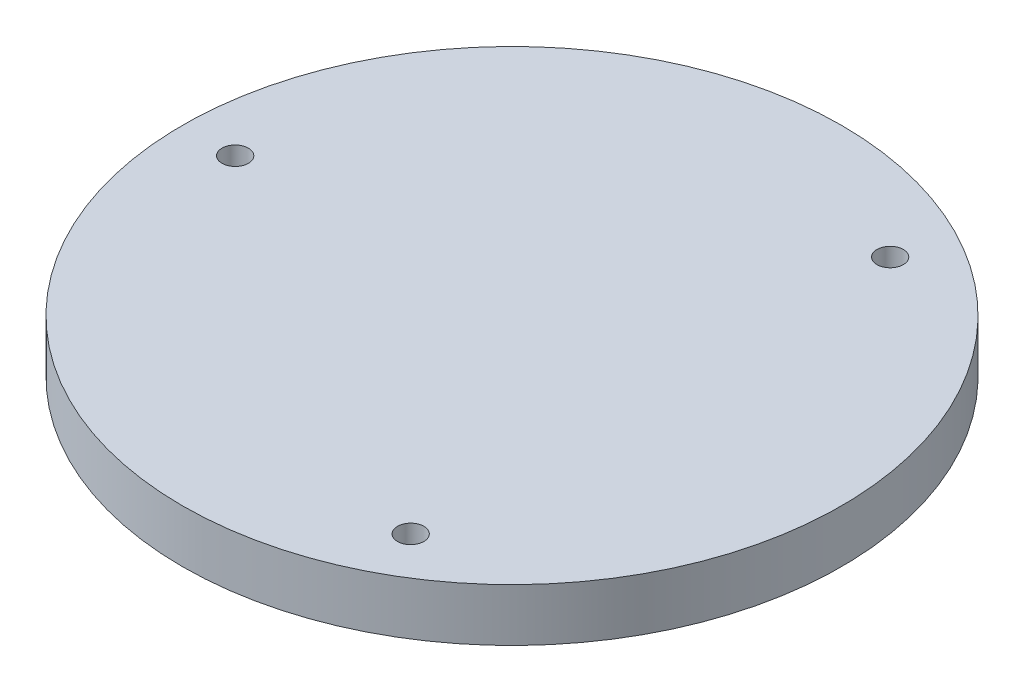
ISO-10303-21;
HEADER;
FILE_DESCRIPTION(('STEP AP214'),'2;1');
FILE_NAME('part.step','',(''),(''),'','','');
FILE_SCHEMA(('AUTOMOTIVE_DESIGN { 1 0 10303 214 1 1 1 1 }'));
ENDSEC;
DATA;
#1=APPLICATION_CONTEXT('core data for automotive mechanical design processes');
#2=APPLICATION_PROTOCOL_DEFINITION('international standard','automotive_design',2000,#1);
#3=PRODUCT_CONTEXT('',#1,'mechanical');
#4=PRODUCT('Part','Part','',(#3));
#5=PRODUCT_RELATED_PRODUCT_CATEGORY('part','',(#4));
#6=PRODUCT_DEFINITION_FORMATION('','',#4);
#7=PRODUCT_DEFINITION_CONTEXT('part definition',#1,'design');
#8=PRODUCT_DEFINITION('design','',#6,#7);
#9=PRODUCT_DEFINITION_SHAPE('','',#8);
#10=(LENGTH_UNIT() NAMED_UNIT(*) SI_UNIT(.MILLI.,.METRE.));
#11=(NAMED_UNIT(*) PLANE_ANGLE_UNIT() SI_UNIT($,.RADIAN.));
#12=(NAMED_UNIT(*) SI_UNIT($,.STERADIAN.) SOLID_ANGLE_UNIT());
#13=UNCERTAINTY_MEASURE_WITH_UNIT(LENGTH_MEASURE(1.E-05),#10,'distance_accuracy_value','');
#14=(GEOMETRIC_REPRESENTATION_CONTEXT(3) GLOBAL_UNCERTAINTY_ASSIGNED_CONTEXT((#13)) GLOBAL_UNIT_ASSIGNED_CONTEXT((#10,
#11,#12)) REPRESENTATION_CONTEXT('',''));
#15=CARTESIAN_POINT('',(0.,0.,0.));
#16=DIRECTION('',(0.,0.,1.));
#17=DIRECTION('',(1.,0.,0.));
#18=AXIS2_PLACEMENT_3D('',#15,#16,#17);
#19=CARTESIAN_POINT('',(0.,20.,0.));
#20=DIRECTION('',(0.,-1.,0.));
#21=DIRECTION('',(0.,0.,-1.));
#22=AXIS2_PLACEMENT_3D('',#19,#20,#21);
#23=CYLINDRICAL_SURFACE('',#22,125.);
#24=CARTESIAN_POINT('',(0.,20.,0.));
#25=DIRECTION('',(0.,1.,0.));
#26=DIRECTION('',(0.,0.,1.));
#27=AXIS2_PLACEMENT_3D('',#24,#25,#26);
#28=CIRCLE('',#27,125.);
#29=CARTESIAN_POINT('',(0.,20.,125.));
#30=VERTEX_POINT('',#29);
#31=EDGE_CURVE('E10',#30,#30,#28,.T.);
#32=ORIENTED_EDGE('',*,*,#31,.F.);
#33=EDGE_LOOP('',(#32));
#34=FACE_BOUND('',#33,.T.);
#35=CARTESIAN_POINT('',(0.,0.,0.));
#36=DIRECTION('',(0.,1.,0.));
#37=DIRECTION('',(0.,0.,1.));
#38=AXIS2_PLACEMENT_3D('',#35,#36,#37);
#39=CIRCLE('',#38,125.);
#40=CARTESIAN_POINT('',(0.,0.,125.));
#41=VERTEX_POINT('',#40);
#42=EDGE_CURVE('E39',#41,#41,#39,.T.);
#43=ORIENTED_EDGE('',*,*,#42,.T.);
#44=EDGE_LOOP('',(#43));
#45=FACE_BOUND('',#44,.T.);
#46=ADVANCED_FACE('F36',(#34,#45),#23,.T.);
#47=CARTESIAN_POINT('',(0.,20.,0.));
#48=DIRECTION('',(0.,1.,0.));
#49=DIRECTION('',(0.,0.,1.));
#50=AXIS2_PLACEMENT_3D('',#47,#48,#49);
#51=PLANE('',#50);
#52=CARTESIAN_POINT('',(52.5000000000004,20.,90.9326673973658));
#53=DIRECTION('',(0.,1.,0.));
#54=DIRECTION('',(0.866025403784436,0.,-0.500000000000004));
#55=AXIS2_PLACEMENT_3D('',#52,#53,#54);
#56=CIRCLE('',#55,5.);
#57=CARTESIAN_POINT('',(56.8301270189226,20.,88.4326673973658));
#58=VERTEX_POINT('',#57);
#59=EDGE_CURVE('E71',#58,#58,#56,.T.);
#60=ORIENTED_EDGE('',*,*,#59,.F.);
#61=EDGE_LOOP('',(#60));
#62=FACE_BOUND('',#61,.T.);
#63=CARTESIAN_POINT('',(52.4999999999992,20.,-90.9326673973665));
#64=DIRECTION('',(0.,1.,0.));
#65=DIRECTION('',(-0.866025403784443,0.,-0.499999999999992));
#66=AXIS2_PLACEMENT_3D('',#63,#64,#65);
#67=CIRCLE('',#66,5.);
#68=CARTESIAN_POINT('',(48.1698729810769,20.,-93.4326673973665));
#69=VERTEX_POINT('',#68);
#70=EDGE_CURVE('E80',#69,#69,#67,.T.);
#71=ORIENTED_EDGE('',*,*,#70,.F.);
#72=EDGE_LOOP('',(#71));
#73=FACE_BOUND('',#72,.T.);
#74=CARTESIAN_POINT('',(-105.,20.,0.));
#75=DIRECTION('',(0.,1.,0.));
#76=DIRECTION('',(0.,0.,1.));
#77=AXIS2_PLACEMENT_3D('',#74,#75,#76);
#78=CIRCLE('',#77,5.);
#79=CARTESIAN_POINT('',(-105.,20.,5.));
#80=VERTEX_POINT('',#79);
#81=EDGE_CURVE('E62',#80,#80,#78,.T.);
#82=ORIENTED_EDGE('',*,*,#81,.F.);
#83=EDGE_LOOP('',(#82));
#84=FACE_BOUND('',#83,.T.);
#85=ORIENTED_EDGE('',*,*,#31,.T.);
#86=EDGE_LOOP('',(#85));
#87=FACE_BOUND('',#86,.T.);
#88=ADVANCED_FACE('F102',(#62,#73,#84,#87),#51,.T.);
#89=CARTESIAN_POINT('',(0.,0.,0.));
#90=DIRECTION('',(0.,1.,0.));
#91=DIRECTION('',(0.,0.,1.));
#92=AXIS2_PLACEMENT_3D('',#89,#90,#91);
#93=PLANE('',#92);
#94=CARTESIAN_POINT('',(52.5000000000004,0.,90.9326673973658));
#95=DIRECTION('',(0.,1.,0.));
#96=DIRECTION('',(0.866025403784436,0.,-0.500000000000004));
#97=AXIS2_PLACEMENT_3D('',#94,#95,#96);
#98=CIRCLE('',#97,2.65);
#99=CARTESIAN_POINT('',(54.7949673200292,0.,89.6076673973658));
#100=VERTEX_POINT('',#99);
#101=EDGE_CURVE('E91',#100,#100,#98,.T.);
#102=ORIENTED_EDGE('',*,*,#101,.T.);
#103=EDGE_LOOP('',(#102));
#104=FACE_BOUND('',#103,.T.);
#105=CARTESIAN_POINT('',(52.4999999999992,0.,-90.9326673973665));
#106=DIRECTION('',(0.,1.,0.));
#107=DIRECTION('',(-0.866025403784443,0.,-0.499999999999992));
#108=AXIS2_PLACEMENT_3D('',#105,#106,#107);
#109=CIRCLE('',#108,2.65);
#110=CARTESIAN_POINT('',(50.2050326799704,0.,-92.2576673973665));
#111=VERTEX_POINT('',#110);
#112=EDGE_CURVE('E76',#111,#111,#109,.T.);
#113=ORIENTED_EDGE('',*,*,#112,.T.);
#114=EDGE_LOOP('',(#113));
#115=FACE_BOUND('',#114,.T.);
#116=CARTESIAN_POINT('',(-105.,0.,0.));
#117=DIRECTION('',(0.,1.,0.));
#118=DIRECTION('',(0.,0.,1.));
#119=AXIS2_PLACEMENT_3D('',#116,#117,#118);
#120=CIRCLE('',#119,2.65);
#121=CARTESIAN_POINT('',(-105.,0.,2.65));
#122=VERTEX_POINT('',#121);
#123=EDGE_CURVE('E49',#122,#122,#120,.T.);
#124=ORIENTED_EDGE('',*,*,#123,.T.);
#125=EDGE_LOOP('',(#124));
#126=FACE_BOUND('',#125,.T.);
#127=ORIENTED_EDGE('',*,*,#42,.F.);
#128=EDGE_LOOP('',(#127));
#129=FACE_BOUND('',#128,.T.);
#130=ADVANCED_FACE('F105',(#104,#115,#126,#129),#93,.F.);
#131=CARTESIAN_POINT('',(-105.,20.,0.));
#132=DIRECTION('',(0.,1.,0.));
#133=DIRECTION('',(0.,0.,1.));
#134=AXIS2_PLACEMENT_3D('',#131,#132,#133);
#135=CYLINDRICAL_SURFACE('',#134,2.65);
#136=ORIENTED_EDGE('',*,*,#123,.F.);
#137=EDGE_LOOP('',(#136));
#138=FACE_BOUND('',#137,.T.);
#139=CARTESIAN_POINT('',(-105.,4.6,0.));
#140=DIRECTION('',(0.,1.,0.));
#141=DIRECTION('',(0.,0.,1.));
#142=AXIS2_PLACEMENT_3D('',#139,#140,#141);
#143=CIRCLE('',#142,2.65);
#144=CARTESIAN_POINT('',(-105.,4.6,2.65));
#145=VERTEX_POINT('',#144);
#146=EDGE_CURVE('E54',#145,#145,#143,.T.);
#147=ORIENTED_EDGE('',*,*,#146,.T.);
#148=EDGE_LOOP('',(#147));
#149=FACE_BOUND('',#148,.T.);
#150=ADVANCED_FACE('F124',(#138,#149),#135,.F.);
#151=CARTESIAN_POINT('',(-102.35,4.6,0.));
#152=DIRECTION('',(0.,-1.,0.));
#153=DIRECTION('',(0.,0.,-1.));
#154=AXIS2_PLACEMENT_3D('',#151,#152,#153);
#155=PLANE('',#154);
#156=ORIENTED_EDGE('',*,*,#146,.F.);
#157=EDGE_LOOP('',(#156));
#158=FACE_BOUND('',#157,.T.);
#159=CARTESIAN_POINT('',(-105.,4.6,0.));
#160=DIRECTION('',(0.,1.,0.));
#161=DIRECTION('',(0.,0.,1.));
#162=AXIS2_PLACEMENT_3D('',#159,#160,#161);
#163=CIRCLE('',#162,4.99999999999999);
#164=CARTESIAN_POINT('',(-105.,4.6,4.99999999999999));
#165=VERTEX_POINT('',#164);
#166=EDGE_CURVE('E58',#165,#165,#163,.T.);
#167=ORIENTED_EDGE('',*,*,#166,.T.);
#168=EDGE_LOOP('',(#167));
#169=FACE_BOUND('',#168,.T.);
#170=ADVANCED_FACE('F114',(#158,#169),#155,.F.);
#171=CARTESIAN_POINT('',(-105.,20.,0.));
#172=DIRECTION('',(0.,1.,0.));
#173=DIRECTION('',(0.,0.,1.));
#174=AXIS2_PLACEMENT_3D('',#171,#172,#173);
#175=CYLINDRICAL_SURFACE('',#174,5.);
#176=ORIENTED_EDGE('',*,*,#166,.F.);
#177=EDGE_LOOP('',(#176));
#178=FACE_BOUND('',#177,.T.);
#179=ORIENTED_EDGE('',*,*,#81,.T.);
#180=EDGE_LOOP('',(#179));
#181=FACE_BOUND('',#180,.T.);
#182=ADVANCED_FACE('F111',(#178,#181),#175,.F.);
#183=CARTESIAN_POINT('',(52.4999999999992,20.,-90.9326673973665));
#184=DIRECTION('',(0.,1.,0.));
#185=DIRECTION('',(-0.866025403784443,0.,-0.499999999999992));
#186=AXIS2_PLACEMENT_3D('',#183,#184,#185);
#187=CYLINDRICAL_SURFACE('',#186,2.65);
#188=ORIENTED_EDGE('',*,*,#112,.F.);
#189=EDGE_LOOP('',(#188));
#190=FACE_BOUND('',#189,.T.);
#191=CARTESIAN_POINT('',(52.4999999999992,4.6,-90.9326673973665));
#192=DIRECTION('',(0.,1.,0.));
#193=DIRECTION('',(-0.866025403784443,0.,-0.499999999999992));
#194=AXIS2_PLACEMENT_3D('',#191,#192,#193);
#195=CIRCLE('',#194,2.65);
#196=CARTESIAN_POINT('',(50.2050326799704,4.6,-92.2576673973665));
#197=VERTEX_POINT('',#196);
#198=EDGE_CURVE('E67',#197,#197,#195,.T.);
#199=ORIENTED_EDGE('',*,*,#198,.T.);
#200=EDGE_LOOP('',(#199));
#201=FACE_BOUND('',#200,.T.);
#202=ADVANCED_FACE('F113',(#190,#201),#187,.F.);
#203=CARTESIAN_POINT('',(51.1749999999992,4.6,-88.6377000773378));
#204=DIRECTION('',(0.,-1.,0.));
#205=DIRECTION('',(0.866025403784443,0.,0.499999999999992));
#206=AXIS2_PLACEMENT_3D('',#203,#204,#205);
#207=PLANE('',#206);
#208=ORIENTED_EDGE('',*,*,#198,.F.);
#209=EDGE_LOOP('',(#208));
#210=FACE_BOUND('',#209,.T.);
#211=CARTESIAN_POINT('',(52.4999999999992,4.6,-90.9326673973665));
#212=DIRECTION('',(0.,1.,0.));
#213=DIRECTION('',(-0.866025403784443,0.,-0.499999999999992));
#214=AXIS2_PLACEMENT_3D('',#211,#212,#213);
#215=CIRCLE('',#214,4.99999999999999);
#216=CARTESIAN_POINT('',(48.1698729810769,4.6,-93.4326673973665));
#217=VERTEX_POINT('',#216);
#218=EDGE_CURVE('E72',#217,#217,#215,.T.);
#219=ORIENTED_EDGE('',*,*,#218,.T.);
#220=EDGE_LOOP('',(#219));
#221=FACE_BOUND('',#220,.T.);
#222=ADVANCED_FACE('F121',(#210,#221),#207,.F.);
#223=CARTESIAN_POINT('',(52.4999999999992,20.,-90.9326673973665));
#224=DIRECTION('',(0.,1.,0.));
#225=DIRECTION('',(-0.866025403784443,0.,-0.499999999999992));
#226=AXIS2_PLACEMENT_3D('',#223,#224,#225);
#227=CYLINDRICAL_SURFACE('',#226,5.);
#228=ORIENTED_EDGE('',*,*,#218,.F.);
#229=EDGE_LOOP('',(#228));
#230=FACE_BOUND('',#229,.T.);
#231=ORIENTED_EDGE('',*,*,#70,.T.);
#232=EDGE_LOOP('',(#231));
#233=FACE_BOUND('',#232,.T.);
#234=ADVANCED_FACE('F155',(#230,#233),#227,.F.);
#235=CARTESIAN_POINT('',(52.5000000000004,20.,90.9326673973658));
#236=DIRECTION('',(0.,1.,0.));
#237=DIRECTION('',(0.866025403784436,0.,-0.500000000000004));
#238=AXIS2_PLACEMENT_3D('',#235,#236,#237);
#239=CYLINDRICAL_SURFACE('',#238,2.65);
#240=ORIENTED_EDGE('',*,*,#101,.F.);
#241=EDGE_LOOP('',(#240));
#242=FACE_BOUND('',#241,.T.);
#243=CARTESIAN_POINT('',(52.5000000000004,4.6,90.9326673973658));
#244=DIRECTION('',(0.,1.,0.));
#245=DIRECTION('',(0.866025403784436,0.,-0.500000000000004));
#246=AXIS2_PLACEMENT_3D('',#243,#244,#245);
#247=CIRCLE('',#246,2.65);
#248=CARTESIAN_POINT('',(54.7949673200292,4.6,89.6076673973658));
#249=VERTEX_POINT('',#248);
#250=EDGE_CURVE('E66',#249,#249,#247,.T.);
#251=ORIENTED_EDGE('',*,*,#250,.T.);
#252=EDGE_LOOP('',(#251));
#253=FACE_BOUND('',#252,.T.);
#254=ADVANCED_FACE('F161',(#242,#253),#239,.F.);
#255=CARTESIAN_POINT('',(51.1750000000004,4.6,88.6377000773371));
#256=DIRECTION('',(0.,-1.,0.));
#257=DIRECTION('',(-0.866025403784436,0.,0.500000000000004));
#258=AXIS2_PLACEMENT_3D('',#255,#256,#257);
#259=PLANE('',#258);
#260=ORIENTED_EDGE('',*,*,#250,.F.);
#261=EDGE_LOOP('',(#260));
#262=FACE_BOUND('',#261,.T.);
#263=CARTESIAN_POINT('',(52.5000000000004,4.6,90.9326673973658));
#264=DIRECTION('',(0.,1.,0.));
#265=DIRECTION('',(0.866025403784436,0.,-0.500000000000004));
#266=AXIS2_PLACEMENT_3D('',#263,#264,#265);
#267=CIRCLE('',#266,4.99999999999999);
#268=CARTESIAN_POINT('',(56.8301270189226,4.6,88.4326673973658));
#269=VERTEX_POINT('',#268);
#270=EDGE_CURVE('E87',#269,#269,#267,.T.);
#271=ORIENTED_EDGE('',*,*,#270,.T.);
#272=EDGE_LOOP('',(#271));
#273=FACE_BOUND('',#272,.T.);
#274=ADVANCED_FACE('F166',(#262,#273),#259,.F.);
#275=CARTESIAN_POINT('',(52.5000000000004,20.,90.9326673973658));
#276=DIRECTION('',(0.,1.,0.));
#277=DIRECTION('',(0.866025403784436,0.,-0.500000000000004));
#278=AXIS2_PLACEMENT_3D('',#275,#276,#277);
#279=CYLINDRICAL_SURFACE('',#278,5.);
#280=ORIENTED_EDGE('',*,*,#270,.F.);
#281=EDGE_LOOP('',(#280));
#282=FACE_BOUND('',#281,.T.);
#283=ORIENTED_EDGE('',*,*,#59,.T.);
#284=EDGE_LOOP('',(#283));
#285=FACE_BOUND('',#284,.T.);
#286=ADVANCED_FACE('F100',(#282,#285),#279,.F.);
#287=CLOSED_SHELL('',(#46,#88,#130,#150,#170,#182,#202,#222,#234,#254,#274,#286));
#288=MANIFOLD_SOLID_BREP('B2',#287);
#289=ADVANCED_BREP_SHAPE_REPRESENTATION('',(#18,#288),#14);
#290=SHAPE_DEFINITION_REPRESENTATION(#9,#289);
ENDSEC;
END-ISO-10303-21;
